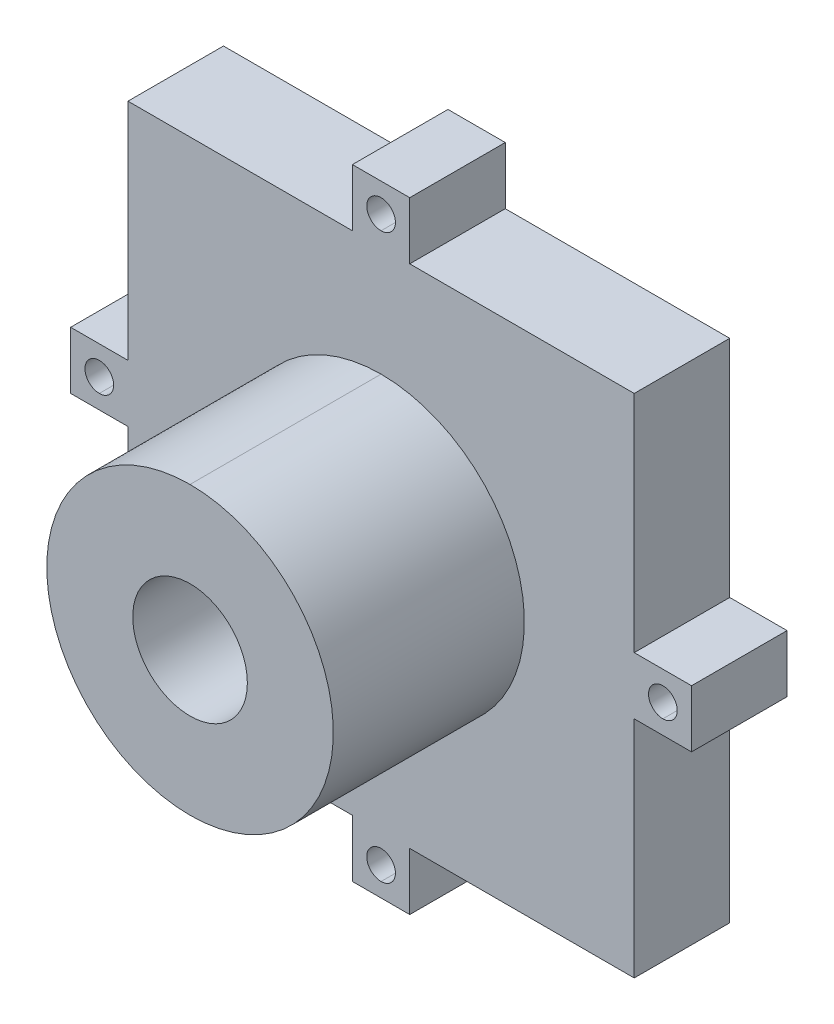
ISO-10303-21;
HEADER;
FILE_DESCRIPTION(('STEP AP214'),'2;1');
FILE_NAME('part.step','',(''),(''),'','','');
FILE_SCHEMA(('AUTOMOTIVE_DESIGN { 1 0 10303 214 1 1 1 1 }'));
ENDSEC;
DATA;
#1=APPLICATION_CONTEXT('core data for automotive mechanical design processes');
#2=APPLICATION_PROTOCOL_DEFINITION('international standard','automotive_design',2000,#1);
#3=PRODUCT_CONTEXT('',#1,'mechanical');
#4=PRODUCT('Part','Part','',(#3));
#5=PRODUCT_RELATED_PRODUCT_CATEGORY('part','',(#4));
#6=PRODUCT_DEFINITION_FORMATION('','',#4);
#7=PRODUCT_DEFINITION_CONTEXT('part definition',#1,'design');
#8=PRODUCT_DEFINITION('design','',#6,#7);
#9=PRODUCT_DEFINITION_SHAPE('','',#8);
#10=(LENGTH_UNIT() NAMED_UNIT(*) SI_UNIT(.MILLI.,.METRE.));
#11=(NAMED_UNIT(*) PLANE_ANGLE_UNIT() SI_UNIT($,.RADIAN.));
#12=(NAMED_UNIT(*) SI_UNIT($,.STERADIAN.) SOLID_ANGLE_UNIT());
#13=UNCERTAINTY_MEASURE_WITH_UNIT(LENGTH_MEASURE(1.E-05),#10,'distance_accuracy_value','');
#14=(GEOMETRIC_REPRESENTATION_CONTEXT(3) GLOBAL_UNCERTAINTY_ASSIGNED_CONTEXT((#13)) GLOBAL_UNIT_ASSIGNED_CONTEXT((#10,
#11,#12)) REPRESENTATION_CONTEXT('',''));
#15=CARTESIAN_POINT('',(0.,0.,0.));
#16=DIRECTION('',(0.,0.,1.));
#17=DIRECTION('',(1.,0.,0.));
#18=AXIS2_PLACEMENT_3D('',#15,#16,#17);
#19=CARTESIAN_POINT('',(0.,0.,10.));
#20=DIRECTION('',(0.,0.,-1.));
#21=DIRECTION('',(0.,1.,0.));
#22=AXIS2_PLACEMENT_3D('',#19,#20,#21);
#23=CYLINDRICAL_SURFACE('',#22,15.);
#24=DIRECTION('',(0.,0.,1.));
#25=VECTOR('',#24,1.);
#26=CARTESIAN_POINT('',(0.,15.,10.));
#27=LINE('',#26,#25);
#28=CARTESIAN_POINT('',(0.,15.,10.));
#29=VERTEX_POINT('',#28);
#30=CARTESIAN_POINT('',(0.,15.,30.));
#31=VERTEX_POINT('',#30);
#32=EDGE_CURVE('E407',#29,#31,#27,.T.);
#33=ORIENTED_EDGE('',*,*,#32,.T.);
#34=CARTESIAN_POINT('',(0.,0.,30.));
#35=DIRECTION('',(0.,0.,1.));
#36=DIRECTION('',(1.,0.,0.));
#37=AXIS2_PLACEMENT_3D('',#34,#35,#36);
#38=CIRCLE('',#37,15.);
#39=CARTESIAN_POINT('',(0.,-15.,30.));
#40=VERTEX_POINT('',#39);
#41=EDGE_CURVE('E58',#40,#31,#38,.T.);
#42=ORIENTED_EDGE('',*,*,#41,.F.);
#43=DIRECTION('',(0.,0.,1.));
#44=VECTOR('',#43,1.);
#45=CARTESIAN_POINT('',(0.,-15.,10.));
#46=LINE('',#45,#44);
#47=CARTESIAN_POINT('',(0.,-15.,10.));
#48=VERTEX_POINT('',#47);
#49=EDGE_CURVE('E221',#48,#40,#46,.T.);
#50=ORIENTED_EDGE('',*,*,#49,.F.);
#51=CARTESIAN_POINT('',(0.,0.,10.));
#52=DIRECTION('',(0.,0.,1.));
#53=DIRECTION('',(0.,-1.,0.));
#54=AXIS2_PLACEMENT_3D('',#51,#52,#53);
#55=CIRCLE('',#54,15.);
#56=EDGE_CURVE('E411',#48,#29,#55,.T.);
#57=ORIENTED_EDGE('',*,*,#56,.T.);
#58=EDGE_LOOP('',(#33,#42,#50,#57));
#59=FACE_BOUND('',#58,.T.);
#60=ADVANCED_FACE('F41',(#59),#23,.T.);
#61=CARTESIAN_POINT('',(0.,0.,10.));
#62=DIRECTION('',(0.,0.,-1.));
#63=DIRECTION('',(0.,1.,0.));
#64=AXIS2_PLACEMENT_3D('',#61,#62,#63);
#65=CYLINDRICAL_SURFACE('',#64,15.);
#66=ORIENTED_EDGE('',*,*,#49,.T.);
#67=EDGE_CURVE('E222',#31,#40,#38,.T.);
#68=ORIENTED_EDGE('',*,*,#67,.F.);
#69=ORIENTED_EDGE('',*,*,#32,.F.);
#70=CARTESIAN_POINT('',(0.,0.,10.));
#71=DIRECTION('',(0.,0.,1.));
#72=DIRECTION('',(0.,1.,0.));
#73=AXIS2_PLACEMENT_3D('',#70,#71,#72);
#74=CIRCLE('',#73,15.);
#75=EDGE_CURVE('E218',#29,#48,#74,.T.);
#76=ORIENTED_EDGE('',*,*,#75,.T.);
#77=EDGE_LOOP('',(#66,#68,#69,#76));
#78=FACE_BOUND('',#77,.T.);
#79=ADVANCED_FACE('F638',(#78),#65,.T.);
#80=CARTESIAN_POINT('',(0.,0.,0.));
#81=DIRECTION('',(0.,0.,1.));
#82=DIRECTION('',(1.,0.,0.));
#83=AXIS2_PLACEMENT_3D('',#80,#81,#82);
#84=PLANE('',#83);
#85=CARTESIAN_POINT('',(0.,29.5,0.));
#86=DIRECTION('',(0.,0.,-1.));
#87=DIRECTION('',(0.,-1.,0.));
#88=AXIS2_PLACEMENT_3D('',#85,#86,#87);
#89=CIRCLE('',#88,1.5);
#90=CARTESIAN_POINT('',(0.,28.,0.));
#91=VERTEX_POINT('',#90);
#92=CARTESIAN_POINT('',(0.,31.,0.));
#93=VERTEX_POINT('',#92);
#94=EDGE_CURVE('E243',#91,#93,#89,.T.);
#95=ORIENTED_EDGE('',*,*,#94,.F.);
#96=CARTESIAN_POINT('',(0.,29.5,0.));
#97=DIRECTION('',(0.,0.,-1.));
#98=DIRECTION('',(0.,1.,0.));
#99=AXIS2_PLACEMENT_3D('',#96,#97,#98);
#100=CIRCLE('',#99,1.5);
#101=EDGE_CURVE('E67',#93,#91,#100,.T.);
#102=ORIENTED_EDGE('',*,*,#101,.F.);
#103=EDGE_LOOP('',(#95,#102));
#104=FACE_BOUND('',#103,.T.);
#105=CARTESIAN_POINT('',(-29.5,0.,0.));
#106=DIRECTION('',(0.,0.,-1.));
#107=DIRECTION('',(0.,-1.,0.));
#108=AXIS2_PLACEMENT_3D('',#105,#106,#107);
#109=CIRCLE('',#108,1.5);
#110=CARTESIAN_POINT('',(-29.5,-1.5,0.));
#111=VERTEX_POINT('',#110);
#112=CARTESIAN_POINT('',(-29.5,1.5,0.));
#113=VERTEX_POINT('',#112);
#114=EDGE_CURVE('E259',#111,#113,#109,.T.);
#115=ORIENTED_EDGE('',*,*,#114,.F.);
#116=CARTESIAN_POINT('',(-29.5,0.,0.));
#117=DIRECTION('',(0.,0.,-1.));
#118=DIRECTION('',(0.,1.,0.));
#119=AXIS2_PLACEMENT_3D('',#116,#117,#118);
#120=CIRCLE('',#119,1.5);
#121=EDGE_CURVE('E264',#113,#111,#120,.T.);
#122=ORIENTED_EDGE('',*,*,#121,.F.);
#123=EDGE_LOOP('',(#115,#122));
#124=FACE_BOUND('',#123,.T.);
#125=DIRECTION('',(-1.,0.,0.));
#126=VECTOR('',#125,1.);
#127=CARTESIAN_POINT('',(-3.,26.5,0.));
#128=LINE('',#127,#126);
#129=CARTESIAN_POINT('',(-3.,26.5,0.));
#130=VERTEX_POINT('',#129);
#131=CARTESIAN_POINT('',(-26.5,26.5,0.));
#132=VERTEX_POINT('',#131);
#133=EDGE_CURVE('E368',#130,#132,#128,.T.);
#134=ORIENTED_EDGE('',*,*,#133,.F.);
#135=DIRECTION('',(0.,-1.,0.));
#136=VECTOR('',#135,1.);
#137=CARTESIAN_POINT('',(-3.,32.5,0.));
#138=LINE('',#137,#136);
#139=CARTESIAN_POINT('',(-3.,32.5,0.));
#140=VERTEX_POINT('',#139);
#141=EDGE_CURVE('E250',#140,#130,#138,.T.);
#142=ORIENTED_EDGE('',*,*,#141,.F.);
#143=DIRECTION('',(-1.,0.,0.));
#144=VECTOR('',#143,1.);
#145=CARTESIAN_POINT('',(3.,32.5,0.));
#146=LINE('',#145,#144);
#147=CARTESIAN_POINT('',(3.,32.5,0.));
#148=VERTEX_POINT('',#147);
#149=EDGE_CURVE('E338',#148,#140,#146,.T.);
#150=ORIENTED_EDGE('',*,*,#149,.F.);
#151=DIRECTION('',(0.,1.,0.));
#152=VECTOR('',#151,1.);
#153=CARTESIAN_POINT('',(3.,26.5,0.));
#154=LINE('',#153,#152);
#155=CARTESIAN_POINT('',(3.,26.5,0.));
#156=VERTEX_POINT('',#155);
#157=EDGE_CURVE('E335',#156,#148,#154,.T.);
#158=ORIENTED_EDGE('',*,*,#157,.F.);
#159=DIRECTION('',(-1.,0.,0.));
#160=VECTOR('',#159,1.);
#161=CARTESIAN_POINT('',(26.5,26.5,0.));
#162=LINE('',#161,#160);
#163=CARTESIAN_POINT('',(26.5,26.5,0.));
#164=VERTEX_POINT('',#163);
#165=EDGE_CURVE('E339',#164,#156,#162,.T.);
#166=ORIENTED_EDGE('',*,*,#165,.F.);
#167=DIRECTION('',(0.,1.,0.));
#168=VECTOR('',#167,1.);
#169=CARTESIAN_POINT('',(26.5,3.,0.));
#170=LINE('',#169,#168);
#171=CARTESIAN_POINT('',(26.5,3.,0.));
#172=VERTEX_POINT('',#171);
#173=EDGE_CURVE('E354',#172,#164,#170,.T.);
#174=ORIENTED_EDGE('',*,*,#173,.F.);
#175=DIRECTION('',(-1.,0.,0.));
#176=VECTOR('',#175,1.);
#177=CARTESIAN_POINT('',(32.5,3.,0.));
#178=LINE('',#177,#176);
#179=CARTESIAN_POINT('',(32.5,3.,0.));
#180=VERTEX_POINT('',#179);
#181=EDGE_CURVE('E317',#180,#172,#178,.T.);
#182=ORIENTED_EDGE('',*,*,#181,.F.);
#183=DIRECTION('',(0.,1.,0.));
#184=VECTOR('',#183,1.);
#185=CARTESIAN_POINT('',(32.5,-3.,0.));
#186=LINE('',#185,#184);
#187=CARTESIAN_POINT('',(32.5,-3.,0.));
#188=VERTEX_POINT('',#187);
#189=EDGE_CURVE('E363',#188,#180,#186,.T.);
#190=ORIENTED_EDGE('',*,*,#189,.F.);
#191=DIRECTION('',(1.,0.,0.));
#192=VECTOR('',#191,1.);
#193=CARTESIAN_POINT('',(26.5,-3.,0.));
#194=LINE('',#193,#192);
#195=CARTESIAN_POINT('',(26.5,-3.,0.));
#196=VERTEX_POINT('',#195);
#197=EDGE_CURVE('E385',#196,#188,#194,.T.);
#198=ORIENTED_EDGE('',*,*,#197,.F.);
#199=DIRECTION('',(0.,1.,0.));
#200=VECTOR('',#199,1.);
#201=CARTESIAN_POINT('',(26.5,-26.5,0.));
#202=LINE('',#201,#200);
#203=CARTESIAN_POINT('',(26.5,-26.5,0.));
#204=VERTEX_POINT('',#203);
#205=EDGE_CURVE('E277',#204,#196,#202,.T.);
#206=ORIENTED_EDGE('',*,*,#205,.F.);
#207=DIRECTION('',(1.,0.,0.));
#208=VECTOR('',#207,1.);
#209=CARTESIAN_POINT('',(3.,-26.5,0.));
#210=LINE('',#209,#208);
#211=CARTESIAN_POINT('',(3.,-26.5,0.));
#212=VERTEX_POINT('',#211);
#213=EDGE_CURVE('E278',#212,#204,#210,.T.);
#214=ORIENTED_EDGE('',*,*,#213,.F.);
#215=DIRECTION('',(0.,-1.,0.));
#216=VECTOR('',#215,1.);
#217=CARTESIAN_POINT('',(3.,-26.5,0.));
#218=LINE('',#217,#216);
#219=CARTESIAN_POINT('',(3.,-32.5,0.));
#220=VERTEX_POINT('',#219);
#221=EDGE_CURVE('E11',#212,#220,#218,.T.);
#222=ORIENTED_EDGE('',*,*,#221,.T.);
#223=DIRECTION('',(-1.,0.,0.));
#224=VECTOR('',#223,1.);
#225=CARTESIAN_POINT('',(3.,-32.5,0.));
#226=LINE('',#225,#224);
#227=CARTESIAN_POINT('',(-3.,-32.5,0.));
#228=VERTEX_POINT('',#227);
#229=EDGE_CURVE('E51',#220,#228,#226,.T.);
#230=ORIENTED_EDGE('',*,*,#229,.T.);
#231=DIRECTION('',(0.,1.,0.));
#232=VECTOR('',#231,1.);
#233=CARTESIAN_POINT('',(-3.,-32.5,0.));
#234=LINE('',#233,#232);
#235=CARTESIAN_POINT('',(-3.,-26.5,0.));
#236=VERTEX_POINT('',#235);
#237=EDGE_CURVE('E239',#228,#236,#234,.T.);
#238=ORIENTED_EDGE('',*,*,#237,.T.);
#239=DIRECTION('',(1.,0.,0.));
#240=VECTOR('',#239,1.);
#241=CARTESIAN_POINT('',(-26.5,-26.5,0.));
#242=LINE('',#241,#240);
#243=CARTESIAN_POINT('',(-26.5,-26.5,0.));
#244=VERTEX_POINT('',#243);
#245=EDGE_CURVE('E311',#244,#236,#242,.T.);
#246=ORIENTED_EDGE('',*,*,#245,.F.);
#247=DIRECTION('',(0.,-1.,0.));
#248=VECTOR('',#247,1.);
#249=CARTESIAN_POINT('',(-26.5,-3.,0.));
#250=LINE('',#249,#248);
#251=CARTESIAN_POINT('',(-26.5,-3.,0.));
#252=VERTEX_POINT('',#251);
#253=EDGE_CURVE('E328',#252,#244,#250,.T.);
#254=ORIENTED_EDGE('',*,*,#253,.F.);
#255=DIRECTION('',(-1.,0.,0.));
#256=VECTOR('',#255,1.);
#257=CARTESIAN_POINT('',(-26.5,-3.,0.));
#258=LINE('',#257,#256);
#259=CARTESIAN_POINT('',(-32.5,-3.,0.));
#260=VERTEX_POINT('',#259);
#261=EDGE_CURVE('E235',#252,#260,#258,.T.);
#262=ORIENTED_EDGE('',*,*,#261,.T.);
#263=DIRECTION('',(0.,1.,0.));
#264=VECTOR('',#263,1.);
#265=CARTESIAN_POINT('',(-32.5,-3.,0.));
#266=LINE('',#265,#264);
#267=CARTESIAN_POINT('',(-32.5,3.,0.));
#268=VERTEX_POINT('',#267);
#269=EDGE_CURVE('E240',#260,#268,#266,.T.);
#270=ORIENTED_EDGE('',*,*,#269,.T.);
#271=DIRECTION('',(1.,0.,0.));
#272=VECTOR('',#271,1.);
#273=CARTESIAN_POINT('',(-32.5,3.,0.));
#274=LINE('',#273,#272);
#275=CARTESIAN_POINT('',(-26.5,3.,0.));
#276=VERTEX_POINT('',#275);
#277=EDGE_CURVE('E195',#268,#276,#274,.T.);
#278=ORIENTED_EDGE('',*,*,#277,.T.);
#279=DIRECTION('',(0.,-1.,0.));
#280=VECTOR('',#279,1.);
#281=CARTESIAN_POINT('',(-26.5,26.5,0.));
#282=LINE('',#281,#280);
#283=EDGE_CURVE('E206',#132,#276,#282,.T.);
#284=ORIENTED_EDGE('',*,*,#283,.F.);
#285=EDGE_LOOP('',(#134,#142,#150,#158,#166,#174,#182,#190,#198,#206,#214,#222,#230,#238,#246,
#254,#262,#270,#278,#284));
#286=FACE_BOUND('',#285,.T.);
#287=CARTESIAN_POINT('',(0.,-29.5,0.));
#288=DIRECTION('',(0.,0.,-1.));
#289=DIRECTION('',(0.,1.,0.));
#290=AXIS2_PLACEMENT_3D('',#287,#288,#289);
#291=CIRCLE('',#290,1.5);
#292=CARTESIAN_POINT('',(0.,-28.,0.));
#293=VERTEX_POINT('',#292);
#294=CARTESIAN_POINT('',(0.,-31.,0.));
#295=VERTEX_POINT('',#294);
#296=EDGE_CURVE('E268',#293,#295,#291,.T.);
#297=ORIENTED_EDGE('',*,*,#296,.F.);
#298=CARTESIAN_POINT('',(0.,-29.5,0.));
#299=DIRECTION('',(0.,0.,-1.));
#300=DIRECTION('',(0.,-1.,0.));
#301=AXIS2_PLACEMENT_3D('',#298,#299,#300);
#302=CIRCLE('',#301,1.5);
#303=EDGE_CURVE('E265',#295,#293,#302,.T.);
#304=ORIENTED_EDGE('',*,*,#303,.F.);
#305=EDGE_LOOP('',(#297,#304));
#306=FACE_BOUND('',#305,.T.);
#307=CARTESIAN_POINT('',(29.5,0.,0.));
#308=DIRECTION('',(0.,0.,-1.));
#309=DIRECTION('',(0.,1.,0.));
#310=AXIS2_PLACEMENT_3D('',#307,#308,#309);
#311=CIRCLE('',#310,1.5);
#312=CARTESIAN_POINT('',(29.5,1.5,0.));
#313=VERTEX_POINT('',#312);
#314=CARTESIAN_POINT('',(29.5,-1.5,0.));
#315=VERTEX_POINT('',#314);
#316=EDGE_CURVE('E342',#313,#315,#311,.T.);
#317=ORIENTED_EDGE('',*,*,#316,.F.);
#318=CARTESIAN_POINT('',(29.5,0.,0.));
#319=DIRECTION('',(0.,0.,-1.));
#320=DIRECTION('',(0.,-1.,0.));
#321=AXIS2_PLACEMENT_3D('',#318,#319,#320);
#322=CIRCLE('',#321,1.5);
#323=EDGE_CURVE('E346',#315,#313,#322,.T.);
#324=ORIENTED_EDGE('',*,*,#323,.F.);
#325=EDGE_LOOP('',(#317,#324));
#326=FACE_BOUND('',#325,.T.);
#327=ADVANCED_FACE('F584',(#104,#124,#286,#306,#326),#84,.F.);
#328=CARTESIAN_POINT('',(0.,29.5,10.));
#329=DIRECTION('',(0.,0.,1.));
#330=DIRECTION('',(0.,1.,0.));
#331=AXIS2_PLACEMENT_3D('',#328,#329,#330);
#332=CYLINDRICAL_SURFACE('',#331,1.5);
#333=CARTESIAN_POINT('',(0.,29.5,10.));
#334=DIRECTION('',(0.,0.,-1.));
#335=DIRECTION('',(0.,-1.,0.));
#336=AXIS2_PLACEMENT_3D('',#333,#334,#335);
#337=CIRCLE('',#336,1.5);
#338=CARTESIAN_POINT('',(0.,28.,10.));
#339=VERTEX_POINT('',#338);
#340=CARTESIAN_POINT('',(0.,31.,10.));
#341=VERTEX_POINT('',#340);
#342=EDGE_CURVE('E412',#339,#341,#337,.T.);
#343=ORIENTED_EDGE('',*,*,#342,.F.);
#344=DIRECTION('',(0.,0.,-1.));
#345=VECTOR('',#344,1.);
#346=CARTESIAN_POINT('',(0.,28.,10.));
#347=LINE('',#346,#345);
#348=EDGE_CURVE('E396',#339,#91,#347,.T.);
#349=ORIENTED_EDGE('',*,*,#348,.T.);
#350=ORIENTED_EDGE('',*,*,#94,.T.);
#351=DIRECTION('',(0.,0.,-1.));
#352=VECTOR('',#351,1.);
#353=CARTESIAN_POINT('',(0.,31.,10.));
#354=LINE('',#353,#352);
#355=EDGE_CURVE('E244',#341,#93,#354,.T.);
#356=ORIENTED_EDGE('',*,*,#355,.F.);
#357=EDGE_LOOP('',(#343,#349,#350,#356));
#358=FACE_BOUND('',#357,.T.);
#359=ADVANCED_FACE('F658',(#358),#332,.F.);
#360=CARTESIAN_POINT('',(0.,29.5,10.));
#361=DIRECTION('',(0.,0.,1.));
#362=DIRECTION('',(0.,1.,0.));
#363=AXIS2_PLACEMENT_3D('',#360,#361,#362);
#364=CYLINDRICAL_SURFACE('',#363,1.5);
#365=ORIENTED_EDGE('',*,*,#101,.T.);
#366=ORIENTED_EDGE('',*,*,#348,.F.);
#367=CARTESIAN_POINT('',(0.,29.5,10.));
#368=DIRECTION('',(0.,0.,-1.));
#369=DIRECTION('',(0.,1.,0.));
#370=AXIS2_PLACEMENT_3D('',#367,#368,#369);
#371=CIRCLE('',#370,1.5);
#372=EDGE_CURVE('E416',#341,#339,#371,.T.);
#373=ORIENTED_EDGE('',*,*,#372,.F.);
#374=ORIENTED_EDGE('',*,*,#355,.T.);
#375=EDGE_LOOP('',(#365,#366,#373,#374));
#376=FACE_BOUND('',#375,.T.);
#377=ADVANCED_FACE('F666',(#376),#364,.F.);
#378=CARTESIAN_POINT('',(-29.5,0.,10.));
#379=DIRECTION('',(0.,0.,1.));
#380=DIRECTION('',(0.,1.,0.));
#381=AXIS2_PLACEMENT_3D('',#378,#379,#380);
#382=CYLINDRICAL_SURFACE('',#381,1.5);
#383=CARTESIAN_POINT('',(-29.5,0.,10.));
#384=DIRECTION('',(0.,0.,-1.));
#385=DIRECTION('',(0.,-1.,0.));
#386=AXIS2_PLACEMENT_3D('',#383,#384,#385);
#387=CIRCLE('',#386,1.5);
#388=CARTESIAN_POINT('',(-29.5,-1.5,10.));
#389=VERTEX_POINT('',#388);
#390=CARTESIAN_POINT('',(-29.5,1.5,10.));
#391=VERTEX_POINT('',#390);
#392=EDGE_CURVE('E377',#389,#391,#387,.T.);
#393=ORIENTED_EDGE('',*,*,#392,.F.);
#394=DIRECTION('',(0.,0.,-1.));
#395=VECTOR('',#394,1.);
#396=CARTESIAN_POINT('',(-29.5,-1.5,10.));
#397=LINE('',#396,#395);
#398=EDGE_CURVE('E263',#389,#111,#397,.T.);
#399=ORIENTED_EDGE('',*,*,#398,.T.);
#400=ORIENTED_EDGE('',*,*,#114,.T.);
#401=DIRECTION('',(0.,0.,-1.));
#402=VECTOR('',#401,1.);
#403=CARTESIAN_POINT('',(-29.5,1.5,10.));
#404=LINE('',#403,#402);
#405=EDGE_CURVE('E372',#391,#113,#404,.T.);
#406=ORIENTED_EDGE('',*,*,#405,.F.);
#407=EDGE_LOOP('',(#393,#399,#400,#406));
#408=FACE_BOUND('',#407,.T.);
#409=ADVANCED_FACE('F652',(#408),#382,.F.);
#410=CARTESIAN_POINT('',(-29.5,0.,10.));
#411=DIRECTION('',(0.,0.,1.));
#412=DIRECTION('',(0.,1.,0.));
#413=AXIS2_PLACEMENT_3D('',#410,#411,#412);
#414=CYLINDRICAL_SURFACE('',#413,1.5);
#415=ORIENTED_EDGE('',*,*,#121,.T.);
#416=ORIENTED_EDGE('',*,*,#398,.F.);
#417=CARTESIAN_POINT('',(-29.5,0.,10.));
#418=DIRECTION('',(0.,0.,-1.));
#419=DIRECTION('',(0.,1.,0.));
#420=AXIS2_PLACEMENT_3D('',#417,#418,#419);
#421=CIRCLE('',#420,1.5);
#422=EDGE_CURVE('E373',#391,#389,#421,.T.);
#423=ORIENTED_EDGE('',*,*,#422,.F.);
#424=ORIENTED_EDGE('',*,*,#405,.T.);
#425=EDGE_LOOP('',(#415,#416,#423,#424));
#426=FACE_BOUND('',#425,.T.);
#427=ADVANCED_FACE('F655',(#426),#414,.F.);
#428=CARTESIAN_POINT('',(26.5,26.5,0.));
#429=DIRECTION('',(0.,1.,0.));
#430=DIRECTION('',(-1.,0.,0.));
#431=AXIS2_PLACEMENT_3D('',#428,#429,#430);
#432=PLANE('',#431);
#433=ORIENTED_EDGE('',*,*,#133,.T.);
#434=DIRECTION('',(0.,0.,1.));
#435=VECTOR('',#434,1.);
#436=CARTESIAN_POINT('',(-26.5,26.5,0.));
#437=LINE('',#436,#435);
#438=CARTESIAN_POINT('',(-26.5,26.5,10.));
#439=VERTEX_POINT('',#438);
#440=EDGE_CURVE('E249',#132,#439,#437,.T.);
#441=ORIENTED_EDGE('',*,*,#440,.T.);
#442=DIRECTION('',(-1.,0.,0.));
#443=VECTOR('',#442,1.);
#444=CARTESIAN_POINT('',(-3.,26.5,10.));
#445=LINE('',#444,#443);
#446=CARTESIAN_POINT('',(-3.,26.5,10.));
#447=VERTEX_POINT('',#446);
#448=EDGE_CURVE('E483',#447,#439,#445,.T.);
#449=ORIENTED_EDGE('',*,*,#448,.F.);
#450=DIRECTION('',(0.,0.,1.));
#451=VECTOR('',#450,1.);
#452=CARTESIAN_POINT('',(-3.,26.5,0.));
#453=LINE('',#452,#451);
#454=EDGE_CURVE('E258',#130,#447,#453,.T.);
#455=ORIENTED_EDGE('',*,*,#454,.F.);
#456=EDGE_LOOP('',(#433,#441,#449,#455));
#457=FACE_BOUND('',#456,.T.);
#458=ADVANCED_FACE('F742',(#457),#432,.T.);
#459=CARTESIAN_POINT('',(-3.,32.5,10.));
#460=DIRECTION('',(-1.,0.,0.));
#461=DIRECTION('',(0.,-1.,0.));
#462=AXIS2_PLACEMENT_3D('',#459,#460,#461);
#463=PLANE('',#462);
#464=DIRECTION('',(0.,-1.,0.));
#465=VECTOR('',#464,1.);
#466=CARTESIAN_POINT('',(-3.,32.5,10.));
#467=LINE('',#466,#465);
#468=CARTESIAN_POINT('',(-3.,32.5,10.));
#469=VERTEX_POINT('',#468);
#470=EDGE_CURVE('E460',#469,#447,#467,.T.);
#471=ORIENTED_EDGE('',*,*,#470,.F.);
#472=DIRECTION('',(0.,0.,-1.));
#473=VECTOR('',#472,1.);
#474=CARTESIAN_POINT('',(-3.,32.5,10.));
#475=LINE('',#474,#473);
#476=EDGE_CURVE('E245',#469,#140,#475,.T.);
#477=ORIENTED_EDGE('',*,*,#476,.T.);
#478=ORIENTED_EDGE('',*,*,#141,.T.);
#479=ORIENTED_EDGE('',*,*,#454,.T.);
#480=EDGE_LOOP('',(#471,#477,#478,#479));
#481=FACE_BOUND('',#480,.T.);
#482=ADVANCED_FACE('F739',(#481),#463,.T.);
#483=CARTESIAN_POINT('',(3.,32.5,10.));
#484=DIRECTION('',(0.,1.,0.));
#485=DIRECTION('',(-1.,0.,0.));
#486=AXIS2_PLACEMENT_3D('',#483,#484,#485);
#487=PLANE('',#486);
#488=DIRECTION('',(0.,0.,-1.));
#489=VECTOR('',#488,1.);
#490=CARTESIAN_POINT('',(3.,32.5,10.));
#491=LINE('',#490,#489);
#492=CARTESIAN_POINT('',(3.,32.5,10.));
#493=VERTEX_POINT('',#492);
#494=EDGE_CURVE('E453',#493,#148,#491,.T.);
#495=ORIENTED_EDGE('',*,*,#494,.T.);
#496=ORIENTED_EDGE('',*,*,#149,.T.);
#497=ORIENTED_EDGE('',*,*,#476,.F.);
#498=DIRECTION('',(-1.,0.,0.));
#499=VECTOR('',#498,1.);
#500=CARTESIAN_POINT('',(3.,32.5,10.));
#501=LINE('',#500,#499);
#502=EDGE_CURVE('E294',#493,#469,#501,.T.);
#503=ORIENTED_EDGE('',*,*,#502,.F.);
#504=EDGE_LOOP('',(#495,#496,#497,#503));
#505=FACE_BOUND('',#504,.T.);
#506=ADVANCED_FACE('F698',(#505),#487,.T.);
#507=CARTESIAN_POINT('',(3.,26.5,10.));
#508=DIRECTION('',(1.,0.,0.));
#509=DIRECTION('',(0.,1.,0.));
#510=AXIS2_PLACEMENT_3D('',#507,#508,#509);
#511=PLANE('',#510);
#512=ORIENTED_EDGE('',*,*,#157,.T.);
#513=ORIENTED_EDGE('',*,*,#494,.F.);
#514=DIRECTION('',(0.,1.,0.));
#515=VECTOR('',#514,1.);
#516=CARTESIAN_POINT('',(3.,26.5,10.));
#517=LINE('',#516,#515);
#518=CARTESIAN_POINT('',(3.,26.5,10.));
#519=VERTEX_POINT('',#518);
#520=EDGE_CURVE('E289',#519,#493,#517,.T.);
#521=ORIENTED_EDGE('',*,*,#520,.F.);
#522=DIRECTION('',(0.,0.,1.));
#523=VECTOR('',#522,1.);
#524=CARTESIAN_POINT('',(3.,26.5,0.));
#525=LINE('',#524,#523);
#526=EDGE_CURVE('E350',#156,#519,#525,.T.);
#527=ORIENTED_EDGE('',*,*,#526,.F.);
#528=EDGE_LOOP('',(#512,#513,#521,#527));
#529=FACE_BOUND('',#528,.T.);
#530=ADVANCED_FACE('F686',(#529),#511,.T.);
#531=CARTESIAN_POINT('',(26.5,26.5,0.));
#532=DIRECTION('',(0.,1.,0.));
#533=DIRECTION('',(-1.,0.,0.));
#534=AXIS2_PLACEMENT_3D('',#531,#532,#533);
#535=PLANE('',#534);
#536=DIRECTION('',(-1.,0.,0.));
#537=VECTOR('',#536,1.);
#538=CARTESIAN_POINT('',(26.5,26.5,10.));
#539=LINE('',#538,#537);
#540=CARTESIAN_POINT('',(26.5,26.5,10.));
#541=VERTEX_POINT('',#540);
#542=EDGE_CURVE('E293',#541,#519,#539,.T.);
#543=ORIENTED_EDGE('',*,*,#542,.F.);
#544=DIRECTION('',(0.,0.,1.));
#545=VECTOR('',#544,1.);
#546=CARTESIAN_POINT('',(26.5,26.5,0.));
#547=LINE('',#546,#545);
#548=EDGE_CURVE('E316',#164,#541,#547,.T.);
#549=ORIENTED_EDGE('',*,*,#548,.F.);
#550=ORIENTED_EDGE('',*,*,#165,.T.);
#551=ORIENTED_EDGE('',*,*,#526,.T.);
#552=EDGE_LOOP('',(#543,#549,#550,#551));
#553=FACE_BOUND('',#552,.T.);
#554=ADVANCED_FACE('F683',(#553),#535,.T.);
#555=CARTESIAN_POINT('',(26.5,-26.5,0.));
#556=DIRECTION('',(1.,0.,0.));
#557=DIRECTION('',(0.,1.,0.));
#558=AXIS2_PLACEMENT_3D('',#555,#556,#557);
#559=PLANE('',#558);
#560=ORIENTED_EDGE('',*,*,#173,.T.);
#561=ORIENTED_EDGE('',*,*,#548,.T.);
#562=DIRECTION('',(0.,1.,0.));
#563=VECTOR('',#562,1.);
#564=CARTESIAN_POINT('',(26.5,3.,10.));
#565=LINE('',#564,#563);
#566=CARTESIAN_POINT('',(26.5,3.,10.));
#567=VERTEX_POINT('',#566);
#568=EDGE_CURVE('E438',#567,#541,#565,.T.);
#569=ORIENTED_EDGE('',*,*,#568,.F.);
#570=DIRECTION('',(0.,0.,1.));
#571=VECTOR('',#570,1.);
#572=CARTESIAN_POINT('',(26.5,3.,0.));
#573=LINE('',#572,#571);
#574=EDGE_CURVE('E330',#172,#567,#573,.T.);
#575=ORIENTED_EDGE('',*,*,#574,.F.);
#576=EDGE_LOOP('',(#560,#561,#569,#575));
#577=FACE_BOUND('',#576,.T.);
#578=ADVANCED_FACE('F685',(#577),#559,.T.);
#579=CARTESIAN_POINT('',(32.5,3.,10.));
#580=DIRECTION('',(0.,1.,0.));
#581=DIRECTION('',(-1.,0.,0.));
#582=AXIS2_PLACEMENT_3D('',#579,#580,#581);
#583=PLANE('',#582);
#584=DIRECTION('',(-1.,0.,0.));
#585=VECTOR('',#584,1.);
#586=CARTESIAN_POINT('',(32.5,3.,10.));
#587=LINE('',#586,#585);
#588=CARTESIAN_POINT('',(32.5,3.,10.));
#589=VERTEX_POINT('',#588);
#590=EDGE_CURVE('E367',#589,#567,#587,.T.);
#591=ORIENTED_EDGE('',*,*,#590,.F.);
#592=DIRECTION('',(0.,0.,-1.));
#593=VECTOR('',#592,1.);
#594=CARTESIAN_POINT('',(32.5,3.,10.));
#595=LINE('',#594,#593);
#596=EDGE_CURVE('E312',#589,#180,#595,.T.);
#597=ORIENTED_EDGE('',*,*,#596,.T.);
#598=ORIENTED_EDGE('',*,*,#181,.T.);
#599=ORIENTED_EDGE('',*,*,#574,.T.);
#600=EDGE_LOOP('',(#591,#597,#598,#599));
#601=FACE_BOUND('',#600,.T.);
#602=ADVANCED_FACE('F691',(#601),#583,.T.);
#603=CARTESIAN_POINT('',(32.5,-3.,10.));
#604=DIRECTION('',(1.,0.,0.));
#605=DIRECTION('',(0.,1.,0.));
#606=AXIS2_PLACEMENT_3D('',#603,#604,#605);
#607=PLANE('',#606);
#608=DIRECTION('',(0.,0.,-1.));
#609=VECTOR('',#608,1.);
#610=CARTESIAN_POINT('',(32.5,-3.,10.));
#611=LINE('',#610,#609);
#612=CARTESIAN_POINT('',(32.5,-3.,10.));
#613=VERTEX_POINT('',#612);
#614=EDGE_CURVE('E334',#613,#188,#611,.T.);
#615=ORIENTED_EDGE('',*,*,#614,.T.);
#616=ORIENTED_EDGE('',*,*,#189,.T.);
#617=ORIENTED_EDGE('',*,*,#596,.F.);
#618=DIRECTION('',(0.,1.,0.));
#619=VECTOR('',#618,1.);
#620=CARTESIAN_POINT('',(32.5,-3.,10.));
#621=LINE('',#620,#619);
#622=EDGE_CURVE('E288',#613,#589,#621,.T.);
#623=ORIENTED_EDGE('',*,*,#622,.F.);
#624=EDGE_LOOP('',(#615,#616,#617,#623));
#625=FACE_BOUND('',#624,.T.);
#626=ADVANCED_FACE('F721',(#625),#607,.T.);
#627=CARTESIAN_POINT('',(26.5,-3.,10.));
#628=DIRECTION('',(0.,-1.,0.));
#629=DIRECTION('',(1.,0.,0.));
#630=AXIS2_PLACEMENT_3D('',#627,#628,#629);
#631=PLANE('',#630);
#632=ORIENTED_EDGE('',*,*,#197,.T.);
#633=ORIENTED_EDGE('',*,*,#614,.F.);
#634=DIRECTION('',(1.,0.,0.));
#635=VECTOR('',#634,1.);
#636=CARTESIAN_POINT('',(26.5,-3.,10.));
#637=LINE('',#636,#635);
#638=CARTESIAN_POINT('',(26.5,-3.,10.));
#639=VERTEX_POINT('',#638);
#640=EDGE_CURVE('E284',#639,#613,#637,.T.);
#641=ORIENTED_EDGE('',*,*,#640,.F.);
#642=DIRECTION('',(0.,0.,1.));
#643=VECTOR('',#642,1.);
#644=CARTESIAN_POINT('',(26.5,-3.,0.));
#645=LINE('',#644,#643);
#646=EDGE_CURVE('E273',#196,#639,#645,.T.);
#647=ORIENTED_EDGE('',*,*,#646,.F.);
#648=EDGE_LOOP('',(#632,#633,#641,#647));
#649=FACE_BOUND('',#648,.T.);
#650=ADVANCED_FACE('F745',(#649),#631,.T.);
#651=CARTESIAN_POINT('',(26.5,-26.5,0.));
#652=DIRECTION('',(1.,0.,0.));
#653=DIRECTION('',(0.,1.,0.));
#654=AXIS2_PLACEMENT_3D('',#651,#652,#653);
#655=PLANE('',#654);
#656=DIRECTION('',(0.,1.,0.));
#657=VECTOR('',#656,1.);
#658=CARTESIAN_POINT('',(26.5,-26.5,10.));
#659=LINE('',#658,#657);
#660=CARTESIAN_POINT('',(26.5,-26.5,10.));
#661=VERTEX_POINT('',#660);
#662=EDGE_CURVE('E233',#661,#639,#659,.T.);
#663=ORIENTED_EDGE('',*,*,#662,.F.);
#664=DIRECTION('',(0.,0.,1.));
#665=VECTOR('',#664,1.);
#666=CARTESIAN_POINT('',(26.5,-26.5,0.));
#667=LINE('',#666,#665);
#668=EDGE_CURVE('E45',#204,#661,#667,.T.);
#669=ORIENTED_EDGE('',*,*,#668,.F.);
#670=ORIENTED_EDGE('',*,*,#205,.T.);
#671=ORIENTED_EDGE('',*,*,#646,.T.);
#672=EDGE_LOOP('',(#663,#669,#670,#671));
#673=FACE_BOUND('',#672,.T.);
#674=ADVANCED_FACE('F708',(#673),#655,.T.);
#675=CARTESIAN_POINT('',(-26.5,-26.5,0.));
#676=DIRECTION('',(0.,-1.,0.));
#677=DIRECTION('',(1.,0.,0.));
#678=AXIS2_PLACEMENT_3D('',#675,#676,#677);
#679=PLANE('',#678);
#680=ORIENTED_EDGE('',*,*,#213,.T.);
#681=ORIENTED_EDGE('',*,*,#668,.T.);
#682=DIRECTION('',(1.,0.,0.));
#683=VECTOR('',#682,1.);
#684=CARTESIAN_POINT('',(3.,-26.5,10.));
#685=LINE('',#684,#683);
#686=CARTESIAN_POINT('',(3.,-26.5,10.));
#687=VERTEX_POINT('',#686);
#688=EDGE_CURVE('E229',#687,#661,#685,.T.);
#689=ORIENTED_EDGE('',*,*,#688,.F.);
#690=DIRECTION('',(0.,0.,1.));
#691=VECTOR('',#690,1.);
#692=CARTESIAN_POINT('',(3.,-26.5,0.));
#693=LINE('',#692,#691);
#694=EDGE_CURVE('E223',#212,#687,#693,.T.);
#695=ORIENTED_EDGE('',*,*,#694,.F.);
#696=EDGE_LOOP('',(#680,#681,#689,#695));
#697=FACE_BOUND('',#696,.T.);
#698=ADVANCED_FACE('F705',(#697),#679,.T.);
#699=CARTESIAN_POINT('',(3.,-26.5,10.));
#700=DIRECTION('',(-1.,0.,0.));
#701=DIRECTION('',(0.,-1.,0.));
#702=AXIS2_PLACEMENT_3D('',#699,#700,#701);
#703=PLANE('',#702);
#704=DIRECTION('',(0.,0.,-1.));
#705=VECTOR('',#704,1.);
#706=CARTESIAN_POINT('',(3.,-32.5,10.));
#707=LINE('',#706,#705);
#708=CARTESIAN_POINT('',(3.,-32.5,10.));
#709=VERTEX_POINT('',#708);
#710=EDGE_CURVE('E227',#709,#220,#707,.T.);
#711=ORIENTED_EDGE('',*,*,#710,.T.);
#712=ORIENTED_EDGE('',*,*,#221,.F.);
#713=ORIENTED_EDGE('',*,*,#694,.T.);
#714=DIRECTION('',(0.,-1.,0.));
#715=VECTOR('',#714,1.);
#716=CARTESIAN_POINT('',(3.,-26.5,10.));
#717=LINE('',#716,#715);
#718=EDGE_CURVE('E228',#687,#709,#717,.T.);
#719=ORIENTED_EDGE('',*,*,#718,.T.);
#720=EDGE_LOOP('',(#711,#712,#713,#719));
#721=FACE_BOUND('',#720,.T.);
#722=ADVANCED_FACE('F589',(#721),#703,.F.);
#723=CARTESIAN_POINT('',(3.,-32.5,10.));
#724=DIRECTION('',(0.,1.,0.));
#725=DIRECTION('',(-1.,0.,0.));
#726=AXIS2_PLACEMENT_3D('',#723,#724,#725);
#727=PLANE('',#726);
#728=DIRECTION('',(0.,0.,-1.));
#729=VECTOR('',#728,1.);
#730=CARTESIAN_POINT('',(-3.,-32.5,10.));
#731=LINE('',#730,#729);
#732=CARTESIAN_POINT('',(-3.,-32.5,10.));
#733=VERTEX_POINT('',#732);
#734=EDGE_CURVE('E282',#733,#228,#731,.T.);
#735=ORIENTED_EDGE('',*,*,#734,.T.);
#736=ORIENTED_EDGE('',*,*,#229,.F.);
#737=ORIENTED_EDGE('',*,*,#710,.F.);
#738=DIRECTION('',(-1.,0.,0.));
#739=VECTOR('',#738,1.);
#740=CARTESIAN_POINT('',(3.,-32.5,10.));
#741=LINE('',#740,#739);
#742=EDGE_CURVE('E279',#709,#733,#741,.T.);
#743=ORIENTED_EDGE('',*,*,#742,.T.);
#744=EDGE_LOOP('',(#735,#736,#737,#743));
#745=FACE_BOUND('',#744,.T.);
#746=ADVANCED_FACE('F578',(#745),#727,.F.);
#747=CARTESIAN_POINT('',(-3.,-32.5,10.));
#748=DIRECTION('',(1.,0.,0.));
#749=DIRECTION('',(0.,1.,0.));
#750=AXIS2_PLACEMENT_3D('',#747,#748,#749);
#751=PLANE('',#750);
#752=DIRECTION('',(0.,0.,1.));
#753=VECTOR('',#752,1.);
#754=CARTESIAN_POINT('',(-3.,-26.5,0.));
#755=LINE('',#754,#753);
#756=CARTESIAN_POINT('',(-3.,-26.5,10.));
#757=VERTEX_POINT('',#756);
#758=EDGE_CURVE('E216',#236,#757,#755,.T.);
#759=ORIENTED_EDGE('',*,*,#758,.F.);
#760=ORIENTED_EDGE('',*,*,#237,.F.);
#761=ORIENTED_EDGE('',*,*,#734,.F.);
#762=DIRECTION('',(0.,1.,0.));
#763=VECTOR('',#762,1.);
#764=CARTESIAN_POINT('',(-3.,-32.5,10.));
#765=LINE('',#764,#763);
#766=EDGE_CURVE('E283',#733,#757,#765,.T.);
#767=ORIENTED_EDGE('',*,*,#766,.T.);
#768=EDGE_LOOP('',(#759,#760,#761,#767));
#769=FACE_BOUND('',#768,.T.);
#770=ADVANCED_FACE('F594',(#769),#751,.F.);
#771=CARTESIAN_POINT('',(-26.5,-26.5,0.));
#772=DIRECTION('',(0.,-1.,0.));
#773=DIRECTION('',(1.,0.,0.));
#774=AXIS2_PLACEMENT_3D('',#771,#772,#773);
#775=PLANE('',#774);
#776=DIRECTION('',(1.,0.,0.));
#777=VECTOR('',#776,1.);
#778=CARTESIAN_POINT('',(-26.5,-26.5,10.));
#779=LINE('',#778,#777);
#780=CARTESIAN_POINT('',(-26.5,-26.5,10.));
#781=VERTEX_POINT('',#780);
#782=EDGE_CURVE('E232',#781,#757,#779,.T.);
#783=ORIENTED_EDGE('',*,*,#782,.F.);
#784=DIRECTION('',(0.,0.,1.));
#785=VECTOR('',#784,1.);
#786=CARTESIAN_POINT('',(-26.5,-26.5,0.));
#787=LINE('',#786,#785);
#788=EDGE_CURVE('E325',#244,#781,#787,.T.);
#789=ORIENTED_EDGE('',*,*,#788,.F.);
#790=ORIENTED_EDGE('',*,*,#245,.T.);
#791=ORIENTED_EDGE('',*,*,#758,.T.);
#792=EDGE_LOOP('',(#783,#789,#790,#791));
#793=FACE_BOUND('',#792,.T.);
#794=ADVANCED_FACE('F600',(#793),#775,.T.);
#795=CARTESIAN_POINT('',(-26.5,26.5,0.));
#796=DIRECTION('',(-1.,0.,0.));
#797=DIRECTION('',(0.,-1.,0.));
#798=AXIS2_PLACEMENT_3D('',#795,#796,#797);
#799=PLANE('',#798);
#800=ORIENTED_EDGE('',*,*,#253,.T.);
#801=ORIENTED_EDGE('',*,*,#788,.T.);
#802=DIRECTION('',(0.,-1.,0.));
#803=VECTOR('',#802,1.);
#804=CARTESIAN_POINT('',(-26.5,-3.,10.));
#805=LINE('',#804,#803);
#806=CARTESIAN_POINT('',(-26.5,-3.,10.));
#807=VERTEX_POINT('',#806);
#808=EDGE_CURVE('E298',#807,#781,#805,.T.);
#809=ORIENTED_EDGE('',*,*,#808,.F.);
#810=DIRECTION('',(0.,0.,1.));
#811=VECTOR('',#810,1.);
#812=CARTESIAN_POINT('',(-26.5,-3.,0.));
#813=LINE('',#812,#811);
#814=EDGE_CURVE('E251',#252,#807,#813,.T.);
#815=ORIENTED_EDGE('',*,*,#814,.F.);
#816=EDGE_LOOP('',(#800,#801,#809,#815));
#817=FACE_BOUND('',#816,.T.);
#818=ADVANCED_FACE('F603',(#817),#799,.T.);
#819=CARTESIAN_POINT('',(-26.5,-3.,10.));
#820=DIRECTION('',(0.,1.,0.));
#821=DIRECTION('',(-1.,0.,0.));
#822=AXIS2_PLACEMENT_3D('',#819,#820,#821);
#823=PLANE('',#822);
#824=DIRECTION('',(0.,0.,-1.));
#825=VECTOR('',#824,1.);
#826=CARTESIAN_POINT('',(-32.5,-3.,10.));
#827=LINE('',#826,#825);
#828=CARTESIAN_POINT('',(-32.5,-3.,10.));
#829=VERTEX_POINT('',#828);
#830=EDGE_CURVE('E181',#829,#260,#827,.T.);
#831=ORIENTED_EDGE('',*,*,#830,.T.);
#832=ORIENTED_EDGE('',*,*,#261,.F.);
#833=ORIENTED_EDGE('',*,*,#814,.T.);
#834=DIRECTION('',(-1.,0.,0.));
#835=VECTOR('',#834,1.);
#836=CARTESIAN_POINT('',(-26.5,-3.,10.));
#837=LINE('',#836,#835);
#838=EDGE_CURVE('E198',#807,#829,#837,.T.);
#839=ORIENTED_EDGE('',*,*,#838,.T.);
#840=EDGE_LOOP('',(#831,#832,#833,#839));
#841=FACE_BOUND('',#840,.T.);
#842=ADVANCED_FACE('F43',(#841),#823,.F.);
#843=CARTESIAN_POINT('',(-32.5,-3.,10.));
#844=DIRECTION('',(1.,0.,0.));
#845=DIRECTION('',(0.,1.,0.));
#846=AXIS2_PLACEMENT_3D('',#843,#844,#845);
#847=PLANE('',#846);
#848=DIRECTION('',(0.,0.,-1.));
#849=VECTOR('',#848,1.);
#850=CARTESIAN_POINT('',(-32.5,3.,10.));
#851=LINE('',#850,#849);
#852=CARTESIAN_POINT('',(-32.5,3.,10.));
#853=VERTEX_POINT('',#852);
#854=EDGE_CURVE('E179',#853,#268,#851,.T.);
#855=ORIENTED_EDGE('',*,*,#854,.T.);
#856=ORIENTED_EDGE('',*,*,#269,.F.);
#857=ORIENTED_EDGE('',*,*,#830,.F.);
#858=DIRECTION('',(0.,1.,0.));
#859=VECTOR('',#858,1.);
#860=CARTESIAN_POINT('',(-32.5,-3.,10.));
#861=LINE('',#860,#859);
#862=EDGE_CURVE('E175',#829,#853,#861,.T.);
#863=ORIENTED_EDGE('',*,*,#862,.T.);
#864=EDGE_LOOP('',(#855,#856,#857,#863));
#865=FACE_BOUND('',#864,.T.);
#866=ADVANCED_FACE('F177',(#865),#847,.F.);
#867=CARTESIAN_POINT('',(-32.5,3.,10.));
#868=DIRECTION('',(0.,-1.,0.));
#869=DIRECTION('',(1.,0.,0.));
#870=AXIS2_PLACEMENT_3D('',#867,#868,#869);
#871=PLANE('',#870);
#872=DIRECTION('',(0.,0.,1.));
#873=VECTOR('',#872,1.);
#874=CARTESIAN_POINT('',(-26.5,3.,0.));
#875=LINE('',#874,#873);
#876=CARTESIAN_POINT('',(-26.5,3.,10.));
#877=VERTEX_POINT('',#876);
#878=EDGE_CURVE('E212',#276,#877,#875,.T.);
#879=ORIENTED_EDGE('',*,*,#878,.F.);
#880=ORIENTED_EDGE('',*,*,#277,.F.);
#881=ORIENTED_EDGE('',*,*,#854,.F.);
#882=DIRECTION('',(1.,0.,0.));
#883=VECTOR('',#882,1.);
#884=CARTESIAN_POINT('',(-32.5,3.,10.));
#885=LINE('',#884,#883);
#886=EDGE_CURVE('E186',#853,#877,#885,.T.);
#887=ORIENTED_EDGE('',*,*,#886,.T.);
#888=EDGE_LOOP('',(#879,#880,#881,#887));
#889=FACE_BOUND('',#888,.T.);
#890=ADVANCED_FACE('F192',(#889),#871,.F.);
#891=CARTESIAN_POINT('',(-26.5,26.5,0.));
#892=DIRECTION('',(-1.,0.,0.));
#893=DIRECTION('',(0.,-1.,0.));
#894=AXIS2_PLACEMENT_3D('',#891,#892,#893);
#895=PLANE('',#894);
#896=DIRECTION('',(0.,-1.,0.));
#897=VECTOR('',#896,1.);
#898=CARTESIAN_POINT('',(-26.5,26.5,10.));
#899=LINE('',#898,#897);
#900=EDGE_CURVE('E204',#439,#877,#899,.T.);
#901=ORIENTED_EDGE('',*,*,#900,.F.);
#902=ORIENTED_EDGE('',*,*,#440,.F.);
#903=ORIENTED_EDGE('',*,*,#283,.T.);
#904=ORIENTED_EDGE('',*,*,#878,.T.);
#905=EDGE_LOOP('',(#901,#902,#903,#904));
#906=FACE_BOUND('',#905,.T.);
#907=ADVANCED_FACE('F608',(#906),#895,.T.);
#908=CARTESIAN_POINT('',(0.,-29.5,10.));
#909=DIRECTION('',(0.,0.,1.));
#910=DIRECTION('',(0.,-1.,0.));
#911=AXIS2_PLACEMENT_3D('',#908,#909,#910);
#912=CYLINDRICAL_SURFACE('',#911,1.5);
#913=CARTESIAN_POINT('',(0.,-29.5,10.));
#914=DIRECTION('',(0.,0.,-1.));
#915=DIRECTION('',(0.,1.,0.));
#916=AXIS2_PLACEMENT_3D('',#913,#914,#915);
#917=CIRCLE('',#916,1.5);
#918=CARTESIAN_POINT('',(0.,-28.,10.));
#919=VERTEX_POINT('',#918);
#920=CARTESIAN_POINT('',(0.,-31.,10.));
#921=VERTEX_POINT('',#920);
#922=EDGE_CURVE('E302',#919,#921,#917,.T.);
#923=ORIENTED_EDGE('',*,*,#922,.F.);
#924=DIRECTION('',(0.,0.,-1.));
#925=VECTOR('',#924,1.);
#926=CARTESIAN_POINT('',(0.,-28.,10.));
#927=LINE('',#926,#925);
#928=EDGE_CURVE('E389',#919,#293,#927,.T.);
#929=ORIENTED_EDGE('',*,*,#928,.T.);
#930=ORIENTED_EDGE('',*,*,#296,.T.);
#931=DIRECTION('',(0.,0.,-1.));
#932=VECTOR('',#931,1.);
#933=CARTESIAN_POINT('',(0.,-31.,10.));
#934=LINE('',#933,#932);
#935=EDGE_CURVE('E269',#921,#295,#934,.T.);
#936=ORIENTED_EDGE('',*,*,#935,.F.);
#937=EDGE_LOOP('',(#923,#929,#930,#936));
#938=FACE_BOUND('',#937,.T.);
#939=ADVANCED_FACE('F524',(#938),#912,.F.);
#940=CARTESIAN_POINT('',(0.,-29.5,10.));
#941=DIRECTION('',(0.,0.,1.));
#942=DIRECTION('',(0.,-1.,0.));
#943=AXIS2_PLACEMENT_3D('',#940,#941,#942);
#944=CYLINDRICAL_SURFACE('',#943,1.5);
#945=ORIENTED_EDGE('',*,*,#303,.T.);
#946=ORIENTED_EDGE('',*,*,#928,.F.);
#947=CARTESIAN_POINT('',(0.,-29.5,10.));
#948=DIRECTION('',(0.,0.,-1.));
#949=DIRECTION('',(0.,-1.,0.));
#950=AXIS2_PLACEMENT_3D('',#947,#948,#949);
#951=CIRCLE('',#950,1.5);
#952=EDGE_CURVE('E303',#921,#919,#951,.T.);
#953=ORIENTED_EDGE('',*,*,#952,.F.);
#954=ORIENTED_EDGE('',*,*,#935,.T.);
#955=EDGE_LOOP('',(#945,#946,#953,#954));
#956=FACE_BOUND('',#955,.T.);
#957=ADVANCED_FACE('F527',(#956),#944,.F.);
#958=CARTESIAN_POINT('',(29.5,0.,10.));
#959=DIRECTION('',(0.,0.,1.));
#960=DIRECTION('',(0.,-1.,0.));
#961=AXIS2_PLACEMENT_3D('',#958,#959,#960);
#962=CYLINDRICAL_SURFACE('',#961,1.5);
#963=CARTESIAN_POINT('',(29.5,0.,10.));
#964=DIRECTION('',(0.,0.,-1.));
#965=DIRECTION('',(0.,1.,0.));
#966=AXIS2_PLACEMENT_3D('',#963,#964,#965);
#967=CIRCLE('',#966,1.5);
#968=CARTESIAN_POINT('',(29.5,1.5,10.));
#969=VERTEX_POINT('',#968);
#970=CARTESIAN_POINT('',(29.5,-1.5,10.));
#971=VERTEX_POINT('',#970);
#972=EDGE_CURVE('E307',#969,#971,#967,.T.);
#973=ORIENTED_EDGE('',*,*,#972,.F.);
#974=DIRECTION('',(0.,0.,-1.));
#975=VECTOR('',#974,1.);
#976=CARTESIAN_POINT('',(29.5,1.5,10.));
#977=LINE('',#976,#975);
#978=EDGE_CURVE('E321',#969,#313,#977,.T.);
#979=ORIENTED_EDGE('',*,*,#978,.T.);
#980=ORIENTED_EDGE('',*,*,#316,.T.);
#981=DIRECTION('',(0.,0.,-1.));
#982=VECTOR('',#981,1.);
#983=CARTESIAN_POINT('',(29.5,-1.5,10.));
#984=LINE('',#983,#982);
#985=EDGE_CURVE('E415',#971,#315,#984,.T.);
#986=ORIENTED_EDGE('',*,*,#985,.F.);
#987=EDGE_LOOP('',(#973,#979,#980,#986));
#988=FACE_BOUND('',#987,.T.);
#989=ADVANCED_FACE('F714',(#988),#962,.F.);
#990=CARTESIAN_POINT('',(29.5,0.,10.));
#991=DIRECTION('',(0.,0.,1.));
#992=DIRECTION('',(0.,-1.,0.));
#993=AXIS2_PLACEMENT_3D('',#990,#991,#992);
#994=CYLINDRICAL_SURFACE('',#993,1.5);
#995=ORIENTED_EDGE('',*,*,#323,.T.);
#996=ORIENTED_EDGE('',*,*,#978,.F.);
#997=CARTESIAN_POINT('',(29.5,0.,10.));
#998=DIRECTION('',(0.,0.,-1.));
#999=DIRECTION('',(0.,-1.,0.));
#1000=AXIS2_PLACEMENT_3D('',#997,#998,#999);
#1001=CIRCLE('',#1000,1.5);
#1002=EDGE_CURVE('E403',#971,#969,#1001,.T.);
#1003=ORIENTED_EDGE('',*,*,#1002,.F.);
#1004=ORIENTED_EDGE('',*,*,#985,.T.);
#1005=EDGE_LOOP('',(#995,#996,#1003,#1004));
#1006=FACE_BOUND('',#1005,.T.);
#1007=ADVANCED_FACE('F643',(#1006),#994,.F.);
#1008=CARTESIAN_POINT('',(0.,0.,10.));
#1009=DIRECTION('',(0.,0.,1.));
#1010=DIRECTION('',(1.,0.,0.));
#1011=AXIS2_PLACEMENT_3D('',#1008,#1009,#1010);
#1012=PLANE('',#1011);
#1013=ORIENTED_EDGE('',*,*,#56,.F.);
#1014=ORIENTED_EDGE('',*,*,#75,.F.);
#1015=EDGE_LOOP('',(#1013,#1014));
#1016=FACE_BOUND('',#1015,.T.);
#1017=ORIENTED_EDGE('',*,*,#342,.T.);
#1018=ORIENTED_EDGE('',*,*,#372,.T.);
#1019=EDGE_LOOP('',(#1017,#1018));
#1020=FACE_BOUND('',#1019,.T.);
#1021=ORIENTED_EDGE('',*,*,#392,.T.);
#1022=ORIENTED_EDGE('',*,*,#422,.T.);
#1023=EDGE_LOOP('',(#1021,#1022));
#1024=FACE_BOUND('',#1023,.T.);
#1025=ORIENTED_EDGE('',*,*,#782,.T.);
#1026=ORIENTED_EDGE('',*,*,#766,.F.);
#1027=ORIENTED_EDGE('',*,*,#742,.F.);
#1028=ORIENTED_EDGE('',*,*,#718,.F.);
#1029=ORIENTED_EDGE('',*,*,#688,.T.);
#1030=ORIENTED_EDGE('',*,*,#662,.T.);
#1031=ORIENTED_EDGE('',*,*,#640,.T.);
#1032=ORIENTED_EDGE('',*,*,#622,.T.);
#1033=ORIENTED_EDGE('',*,*,#590,.T.);
#1034=ORIENTED_EDGE('',*,*,#568,.T.);
#1035=ORIENTED_EDGE('',*,*,#542,.T.);
#1036=ORIENTED_EDGE('',*,*,#520,.T.);
#1037=ORIENTED_EDGE('',*,*,#502,.T.);
#1038=ORIENTED_EDGE('',*,*,#470,.T.);
#1039=ORIENTED_EDGE('',*,*,#448,.T.);
#1040=ORIENTED_EDGE('',*,*,#900,.T.);
#1041=ORIENTED_EDGE('',*,*,#886,.F.);
#1042=ORIENTED_EDGE('',*,*,#862,.F.);
#1043=ORIENTED_EDGE('',*,*,#838,.F.);
#1044=ORIENTED_EDGE('',*,*,#808,.T.);
#1045=EDGE_LOOP('',(#1025,#1026,#1027,#1028,#1029,#1030,#1031,#1032,#1033,#1034,#1035,#1036,
#1037,#1038,#1039,#1040,#1041,#1042,#1043,#1044));
#1046=FACE_BOUND('',#1045,.T.);
#1047=ORIENTED_EDGE('',*,*,#922,.T.);
#1048=ORIENTED_EDGE('',*,*,#952,.T.);
#1049=EDGE_LOOP('',(#1047,#1048));
#1050=FACE_BOUND('',#1049,.T.);
#1051=ORIENTED_EDGE('',*,*,#972,.T.);
#1052=ORIENTED_EDGE('',*,*,#1002,.T.);
#1053=EDGE_LOOP('',(#1051,#1052));
#1054=FACE_BOUND('',#1053,.T.);
#1055=ADVANCED_FACE('F201',(#1016,#1020,#1024,#1046,#1050,#1054),#1012,.T.);
#1056=CARTESIAN_POINT('',(0.,0.,30.));
#1057=DIRECTION('',(0.,0.,1.));
#1058=DIRECTION('',(0.,1.,0.));
#1059=AXIS2_PLACEMENT_3D('',#1056,#1057,#1058);
#1060=PLANE('',#1059);
#1061=CARTESIAN_POINT('',(0.,0.,30.));
#1062=DIRECTION('',(0.,0.,1.));
#1063=DIRECTION('',(1.,0.,0.));
#1064=AXIS2_PLACEMENT_3D('',#1061,#1062,#1063);
#1065=CIRCLE('',#1064,6.);
#1066=CARTESIAN_POINT('',(6.,0.,30.));
#1067=VERTEX_POINT('',#1066);
#1068=EDGE_CURVE('E615',#1067,#1067,#1065,.T.);
#1069=ORIENTED_EDGE('',*,*,#1068,.F.);
#1070=EDGE_LOOP('',(#1069));
#1071=FACE_BOUND('',#1070,.T.);
#1072=ORIENTED_EDGE('',*,*,#67,.T.);
#1073=ORIENTED_EDGE('',*,*,#41,.T.);
#1074=EDGE_LOOP('',(#1072,#1073));
#1075=FACE_BOUND('',#1074,.T.);
#1076=ADVANCED_FACE('F627',(#1071,#1075),#1060,.T.);
#1077=CARTESIAN_POINT('',(0.,0.,20.));
#1078=DIRECTION('',(0.,0.,1.));
#1079=DIRECTION('',(1.,0.,0.));
#1080=AXIS2_PLACEMENT_3D('',#1077,#1078,#1079);
#1081=CYLINDRICAL_SURFACE('',#1080,6.);
#1082=CARTESIAN_POINT('',(0.,0.,20.));
#1083=DIRECTION('',(0.,0.,1.));
#1084=DIRECTION('',(1.,0.,0.));
#1085=AXIS2_PLACEMENT_3D('',#1082,#1083,#1084);
#1086=CIRCLE('',#1085,6.);
#1087=CARTESIAN_POINT('',(6.,0.,20.));
#1088=VERTEX_POINT('',#1087);
#1089=EDGE_CURVE('E618',#1088,#1088,#1086,.T.);
#1090=ORIENTED_EDGE('',*,*,#1089,.F.);
#1091=EDGE_LOOP('',(#1090));
#1092=FACE_BOUND('',#1091,.T.);
#1093=ORIENTED_EDGE('',*,*,#1068,.T.);
#1094=EDGE_LOOP('',(#1093));
#1095=FACE_BOUND('',#1094,.T.);
#1096=ADVANCED_FACE('F624',(#1092,#1095),#1081,.F.);
#1097=CARTESIAN_POINT('',(0.,0.,20.));
#1098=DIRECTION('',(0.,0.,1.));
#1099=DIRECTION('',(1.,0.,0.));
#1100=AXIS2_PLACEMENT_3D('',#1097,#1098,#1099);
#1101=PLANE('',#1100);
#1102=ORIENTED_EDGE('',*,*,#1089,.T.);
#1103=EDGE_LOOP('',(#1102));
#1104=FACE_BOUND('',#1103,.T.);
#1105=ADVANCED_FACE('F622',(#1104),#1101,.T.);
#1106=CLOSED_SHELL('',(#60,#79,#327,#359,#377,#409,#427,#458,#482,#506,#530,#554,#578,#602,#626,
#650,#674,#698,#722,#746,#770,#794,#818,#842,#866,#890,#907,#939,#957,#989,#1007,#1055,#1076,
#1096,#1105));
#1107=MANIFOLD_SOLID_BREP('B2',#1106);
#1108=ADVANCED_BREP_SHAPE_REPRESENTATION('',(#18,#1107),#14);
#1109=SHAPE_DEFINITION_REPRESENTATION(#9,#1108);
ENDSEC;
END-ISO-10303-21;
